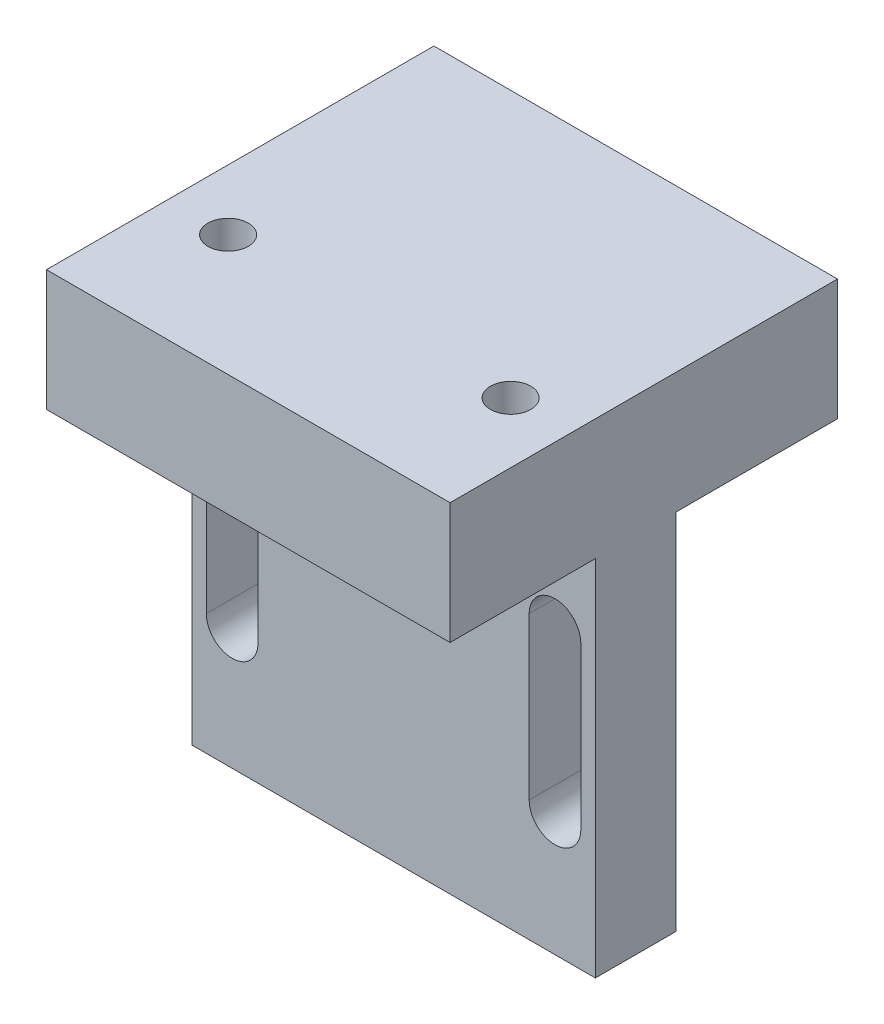
ISO-10303-21;
HEADER;
FILE_DESCRIPTION(('STEP AP214'),'2;1');
FILE_NAME('part.step','',(''),(''),'','','');
FILE_SCHEMA(('AUTOMOTIVE_DESIGN { 1 0 10303 214 1 1 1 1 }'));
ENDSEC;
DATA;
#1=APPLICATION_CONTEXT('core data for automotive mechanical design processes');
#2=APPLICATION_PROTOCOL_DEFINITION('international standard','automotive_design',2000,#1);
#3=PRODUCT_CONTEXT('',#1,'mechanical');
#4=PRODUCT('Part','Part','',(#3));
#5=PRODUCT_RELATED_PRODUCT_CATEGORY('part','',(#4));
#6=PRODUCT_DEFINITION_FORMATION('','',#4);
#7=PRODUCT_DEFINITION_CONTEXT('part definition',#1,'design');
#8=PRODUCT_DEFINITION('design','',#6,#7);
#9=PRODUCT_DEFINITION_SHAPE('','',#8);
#10=(LENGTH_UNIT() NAMED_UNIT(*) SI_UNIT(.MILLI.,.METRE.));
#11=(NAMED_UNIT(*) PLANE_ANGLE_UNIT() SI_UNIT($,.RADIAN.));
#12=(NAMED_UNIT(*) SI_UNIT($,.STERADIAN.) SOLID_ANGLE_UNIT());
#13=UNCERTAINTY_MEASURE_WITH_UNIT(LENGTH_MEASURE(1.E-05),#10,'distance_accuracy_value','');
#14=(GEOMETRIC_REPRESENTATION_CONTEXT(3) GLOBAL_UNCERTAINTY_ASSIGNED_CONTEXT((#13)) GLOBAL_UNIT_ASSIGNED_CONTEXT((#10,
#11,#12)) REPRESENTATION_CONTEXT('',''));
#15=CARTESIAN_POINT('',(0.,0.,0.));
#16=DIRECTION('',(0.,0.,1.));
#17=DIRECTION('',(1.,0.,0.));
#18=AXIS2_PLACEMENT_3D('',#15,#16,#17);
#19=CARTESIAN_POINT('',(-25.,-30.,30.));
#20=DIRECTION('',(1.,0.,0.));
#21=DIRECTION('',(0.,0.,-1.));
#22=AXIS2_PLACEMENT_3D('',#19,#20,#21);
#23=PLANE('',#22);
#24=DIRECTION('',(0.,0.,-1.));
#25=VECTOR('',#24,1.);
#26=CARTESIAN_POINT('',(-25.,15.,97.2681202353686));
#27=LINE('',#26,#25);
#28=CARTESIAN_POINT('',(-25.,15.,20.));
#29=VERTEX_POINT('',#28);
#30=CARTESIAN_POINT('',(-25.,15.,0.));
#31=VERTEX_POINT('',#30);
#32=EDGE_CURVE('E268',#29,#31,#27,.T.);
#33=ORIENTED_EDGE('',*,*,#32,.F.);
#34=DIRECTION('',(0.,1.,0.));
#35=VECTOR('',#34,1.);
#36=CARTESIAN_POINT('',(-25.,-30.,20.));
#37=LINE('',#36,#35);
#38=CARTESIAN_POINT('',(-25.,-30.,20.));
#39=VERTEX_POINT('',#38);
#40=EDGE_CURVE('E260',#39,#29,#37,.T.);
#41=ORIENTED_EDGE('',*,*,#40,.F.);
#42=DIRECTION('',(0.,0.,-1.));
#43=VECTOR('',#42,1.);
#44=CARTESIAN_POINT('',(-25.,-30.,30.));
#45=LINE('',#44,#43);
#46=CARTESIAN_POINT('',(-25.,-30.,30.));
#47=VERTEX_POINT('',#46);
#48=EDGE_CURVE('E12',#47,#39,#45,.T.);
#49=ORIENTED_EDGE('',*,*,#48,.F.);
#50=DIRECTION('',(0.,-1.,0.));
#51=VECTOR('',#50,1.);
#52=CARTESIAN_POINT('',(-25.,-30.,30.));
#53=LINE('',#52,#51);
#54=CARTESIAN_POINT('',(-25.,15.,30.));
#55=VERTEX_POINT('',#54);
#56=EDGE_CURVE('E277',#55,#47,#53,.T.);
#57=ORIENTED_EDGE('',*,*,#56,.F.);
#58=DIRECTION('',(0.,0.,-1.));
#59=VECTOR('',#58,1.);
#60=CARTESIAN_POINT('',(-25.,15.,48.));
#61=LINE('',#60,#59);
#62=CARTESIAN_POINT('',(-25.,15.,48.));
#63=VERTEX_POINT('',#62);
#64=EDGE_CURVE('E168',#63,#55,#61,.T.);
#65=ORIENTED_EDGE('',*,*,#64,.F.);
#66=DIRECTION('',(0.,-1.,0.));
#67=VECTOR('',#66,1.);
#68=CARTESIAN_POINT('',(-25.,30.,48.));
#69=LINE('',#68,#67);
#70=CARTESIAN_POINT('',(-25.,30.,48.));
#71=VERTEX_POINT('',#70);
#72=EDGE_CURVE('E165',#71,#63,#69,.T.);
#73=ORIENTED_EDGE('',*,*,#72,.F.);
#74=DIRECTION('',(0.,0.,-1.));
#75=VECTOR('',#74,1.);
#76=CARTESIAN_POINT('',(-25.,30.,30.));
#77=LINE('',#76,#75);
#78=CARTESIAN_POINT('',(-25.,30.,0.));
#79=VERTEX_POINT('',#78);
#80=EDGE_CURVE('E150',#71,#79,#77,.T.);
#81=ORIENTED_EDGE('',*,*,#80,.T.);
#82=DIRECTION('',(0.,-1.,0.));
#83=VECTOR('',#82,1.);
#84=CARTESIAN_POINT('',(-25.,-30.,0.));
#85=LINE('',#84,#83);
#86=EDGE_CURVE('E263',#79,#31,#85,.T.);
#87=ORIENTED_EDGE('',*,*,#86,.T.);
#88=EDGE_LOOP('',(#33,#41,#49,#57,#65,#73,#81,#87));
#89=FACE_BOUND('',#88,.T.);
#90=ADVANCED_FACE('F36',(#89),#23,.F.);
#91=CARTESIAN_POINT('',(25.,-30.,30.));
#92=DIRECTION('',(0.,1.,0.));
#93=DIRECTION('',(-1.,0.,0.));
#94=AXIS2_PLACEMENT_3D('',#91,#92,#93);
#95=PLANE('',#94);
#96=ORIENTED_EDGE('',*,*,#48,.T.);
#97=DIRECTION('',(-1.,0.,0.));
#98=VECTOR('',#97,1.);
#99=CARTESIAN_POINT('',(25.,-30.,20.));
#100=LINE('',#99,#98);
#101=CARTESIAN_POINT('',(25.,-30.,20.));
#102=VERTEX_POINT('',#101);
#103=EDGE_CURVE('E258',#102,#39,#100,.T.);
#104=ORIENTED_EDGE('',*,*,#103,.F.);
#105=DIRECTION('',(0.,0.,-1.));
#106=VECTOR('',#105,1.);
#107=CARTESIAN_POINT('',(25.,-30.,30.));
#108=LINE('',#107,#106);
#109=CARTESIAN_POINT('',(25.,-30.,30.));
#110=VERTEX_POINT('',#109);
#111=EDGE_CURVE('E44',#110,#102,#108,.T.);
#112=ORIENTED_EDGE('',*,*,#111,.F.);
#113=DIRECTION('',(1.,0.,0.));
#114=VECTOR('',#113,1.);
#115=CARTESIAN_POINT('',(25.,-30.,30.));
#116=LINE('',#115,#114);
#117=EDGE_CURVE('E276',#47,#110,#116,.T.);
#118=ORIENTED_EDGE('',*,*,#117,.F.);
#119=EDGE_LOOP('',(#96,#104,#112,#118));
#120=FACE_BOUND('',#119,.T.);
#121=ADVANCED_FACE('F302',(#120),#95,.F.);
#122=CARTESIAN_POINT('',(25.,-30.,30.));
#123=DIRECTION('',(-1.,0.,0.));
#124=DIRECTION('',(0.,0.,1.));
#125=AXIS2_PLACEMENT_3D('',#122,#123,#124);
#126=PLANE('',#125);
#127=ORIENTED_EDGE('',*,*,#111,.T.);
#128=DIRECTION('',(0.,-1.,0.));
#129=VECTOR('',#128,1.);
#130=CARTESIAN_POINT('',(25.,-30.,20.));
#131=LINE('',#130,#129);
#132=CARTESIAN_POINT('',(25.,15.,20.));
#133=VERTEX_POINT('',#132);
#134=EDGE_CURVE('E261',#133,#102,#131,.T.);
#135=ORIENTED_EDGE('',*,*,#134,.F.);
#136=DIRECTION('',(0.,0.,-1.));
#137=VECTOR('',#136,1.);
#138=CARTESIAN_POINT('',(25.,15.,97.2681202353686));
#139=LINE('',#138,#137);
#140=CARTESIAN_POINT('',(25.,15.,0.));
#141=VERTEX_POINT('',#140);
#142=EDGE_CURVE('E264',#133,#141,#139,.T.);
#143=ORIENTED_EDGE('',*,*,#142,.T.);
#144=DIRECTION('',(0.,1.,0.));
#145=VECTOR('',#144,1.);
#146=CARTESIAN_POINT('',(25.,-30.,0.));
#147=LINE('',#146,#145);
#148=CARTESIAN_POINT('',(25.,30.,0.));
#149=VERTEX_POINT('',#148);
#150=EDGE_CURVE('E283',#141,#149,#147,.T.);
#151=ORIENTED_EDGE('',*,*,#150,.T.);
#152=DIRECTION('',(0.,0.,-1.));
#153=VECTOR('',#152,1.);
#154=CARTESIAN_POINT('',(25.,30.,30.));
#155=LINE('',#154,#153);
#156=CARTESIAN_POINT('',(25.,30.,48.));
#157=VERTEX_POINT('',#156);
#158=EDGE_CURVE('E161',#157,#149,#155,.T.);
#159=ORIENTED_EDGE('',*,*,#158,.F.);
#160=DIRECTION('',(0.,1.,0.));
#161=VECTOR('',#160,1.);
#162=CARTESIAN_POINT('',(25.,15.,48.));
#163=LINE('',#162,#161);
#164=CARTESIAN_POINT('',(25.,15.,48.));
#165=VERTEX_POINT('',#164);
#166=EDGE_CURVE('E176',#165,#157,#163,.T.);
#167=ORIENTED_EDGE('',*,*,#166,.F.);
#168=DIRECTION('',(0.,0.,-1.));
#169=VECTOR('',#168,1.);
#170=CARTESIAN_POINT('',(25.,15.,48.));
#171=LINE('',#170,#169);
#172=CARTESIAN_POINT('',(25.,15.,30.));
#173=VERTEX_POINT('',#172);
#174=EDGE_CURVE('E185',#165,#173,#171,.T.);
#175=ORIENTED_EDGE('',*,*,#174,.T.);
#176=DIRECTION('',(0.,1.,0.));
#177=VECTOR('',#176,1.);
#178=CARTESIAN_POINT('',(25.,-30.,30.));
#179=LINE('',#178,#177);
#180=EDGE_CURVE('E162',#110,#173,#179,.T.);
#181=ORIENTED_EDGE('',*,*,#180,.F.);
#182=EDGE_LOOP('',(#127,#135,#143,#151,#159,#167,#175,#181));
#183=FACE_BOUND('',#182,.T.);
#184=ADVANCED_FACE('F295',(#183),#126,.F.);
#185=CARTESIAN_POINT('',(25.,30.,30.));
#186=DIRECTION('',(0.,-1.,0.));
#187=DIRECTION('',(1.,0.,0.));
#188=AXIS2_PLACEMENT_3D('',#185,#186,#187);
#189=PLANE('',#188);
#190=CARTESIAN_POINT('',(17.5,30.,33.));
#191=DIRECTION('',(0.,1.,0.));
#192=DIRECTION('',(0.,0.,1.));
#193=AXIS2_PLACEMENT_3D('',#190,#191,#192);
#194=CIRCLE('',#193,2.49999999999999);
#195=CARTESIAN_POINT('',(17.5,30.,35.5));
#196=VERTEX_POINT('',#195);
#197=EDGE_CURVE('E465',#196,#196,#194,.T.);
#198=ORIENTED_EDGE('',*,*,#197,.F.);
#199=EDGE_LOOP('',(#198));
#200=FACE_BOUND('',#199,.T.);
#201=CARTESIAN_POINT('',(-17.5,30.,33.));
#202=DIRECTION('',(0.,1.,0.));
#203=DIRECTION('',(0.,0.,1.));
#204=AXIS2_PLACEMENT_3D('',#201,#202,#203);
#205=CIRCLE('',#204,2.49999999999999);
#206=CARTESIAN_POINT('',(-17.5,30.,35.5));
#207=VERTEX_POINT('',#206);
#208=EDGE_CURVE('E467',#207,#207,#205,.T.);
#209=ORIENTED_EDGE('',*,*,#208,.F.);
#210=EDGE_LOOP('',(#209));
#211=FACE_BOUND('',#210,.T.);
#212=DIRECTION('',(-1.,0.,0.));
#213=VECTOR('',#212,1.);
#214=CARTESIAN_POINT('',(25.,30.,0.));
#215=LINE('',#214,#213);
#216=EDGE_CURVE('E157',#149,#79,#215,.T.);
#217=ORIENTED_EDGE('',*,*,#216,.T.);
#218=ORIENTED_EDGE('',*,*,#80,.F.);
#219=DIRECTION('',(-1.,0.,0.));
#220=VECTOR('',#219,1.);
#221=CARTESIAN_POINT('',(25.,30.,48.));
#222=LINE('',#221,#220);
#223=EDGE_CURVE('E155',#157,#71,#222,.T.);
#224=ORIENTED_EDGE('',*,*,#223,.F.);
#225=ORIENTED_EDGE('',*,*,#158,.T.);
#226=EDGE_LOOP('',(#217,#218,#224,#225));
#227=FACE_BOUND('',#226,.T.);
#228=ADVANCED_FACE('F152',(#200,#211,#227),#189,.F.);
#229=CARTESIAN_POINT('',(0.,0.,30.));
#230=DIRECTION('',(0.,0.,1.));
#231=DIRECTION('',(1.,0.,0.));
#232=AXIS2_PLACEMENT_3D('',#229,#230,#231);
#233=PLANE('',#232);
#234=DIRECTION('',(1.,0.,0.));
#235=VECTOR('',#234,1.);
#236=CARTESIAN_POINT('',(-25.,15.,30.));
#237=LINE('',#236,#235);
#238=EDGE_CURVE('E52',#55,#173,#237,.T.);
#239=ORIENTED_EDGE('',*,*,#238,.F.);
#240=ORIENTED_EDGE('',*,*,#56,.T.);
#241=ORIENTED_EDGE('',*,*,#117,.T.);
#242=ORIENTED_EDGE('',*,*,#180,.T.);
#243=EDGE_LOOP('',(#239,#240,#241,#242));
#244=FACE_BOUND('',#243,.T.);
#245=CARTESIAN_POINT('',(-20.,-15.,30.));
#246=DIRECTION('',(0.,0.,-1.));
#247=DIRECTION('',(1.,0.,0.));
#248=AXIS2_PLACEMENT_3D('',#245,#246,#247);
#249=CIRCLE('',#248,3.20000000000001);
#250=CARTESIAN_POINT('',(-16.8,-15.,30.));
#251=VERTEX_POINT('',#250);
#252=CARTESIAN_POINT('',(-23.2,-15.,30.));
#253=VERTEX_POINT('',#252);
#254=EDGE_CURVE('E188',#251,#253,#249,.T.);
#255=ORIENTED_EDGE('',*,*,#254,.T.);
#256=DIRECTION('',(0.,1.,0.));
#257=VECTOR('',#256,1.);
#258=CARTESIAN_POINT('',(-23.2,-15.,30.));
#259=LINE('',#258,#257);
#260=CARTESIAN_POINT('',(-23.2,4.99999999999999,30.));
#261=VERTEX_POINT('',#260);
#262=EDGE_CURVE('E379',#253,#261,#259,.T.);
#263=ORIENTED_EDGE('',*,*,#262,.T.);
#264=CARTESIAN_POINT('',(-20.,4.99999999999999,30.));
#265=DIRECTION('',(0.,0.,-1.));
#266=DIRECTION('',(1.,0.,0.));
#267=AXIS2_PLACEMENT_3D('',#264,#265,#266);
#268=CIRCLE('',#267,3.20000000000001);
#269=CARTESIAN_POINT('',(-16.8,5.,30.));
#270=VERTEX_POINT('',#269);
#271=EDGE_CURVE('E60',#261,#270,#268,.T.);
#272=ORIENTED_EDGE('',*,*,#271,.T.);
#273=DIRECTION('',(0.,-1.,0.));
#274=VECTOR('',#273,1.);
#275=CARTESIAN_POINT('',(-16.8,-15.,30.));
#276=LINE('',#275,#274);
#277=EDGE_CURVE('E208',#270,#251,#276,.T.);
#278=ORIENTED_EDGE('',*,*,#277,.T.);
#279=EDGE_LOOP('',(#255,#263,#272,#278));
#280=FACE_BOUND('',#279,.T.);
#281=CARTESIAN_POINT('',(20.,-15.,30.));
#282=DIRECTION('',(0.,0.,-1.));
#283=DIRECTION('',(-1.,0.,0.));
#284=AXIS2_PLACEMENT_3D('',#281,#282,#283);
#285=CIRCLE('',#284,3.20000000000001);
#286=CARTESIAN_POINT('',(23.2,-15.,30.));
#287=VERTEX_POINT('',#286);
#288=CARTESIAN_POINT('',(16.8,-15.,30.));
#289=VERTEX_POINT('',#288);
#290=EDGE_CURVE('E225',#287,#289,#285,.T.);
#291=ORIENTED_EDGE('',*,*,#290,.T.);
#292=DIRECTION('',(0.,1.,0.));
#293=VECTOR('',#292,1.);
#294=CARTESIAN_POINT('',(16.8,-15.,30.));
#295=LINE('',#294,#293);
#296=CARTESIAN_POINT('',(16.8,5.00000000000001,30.));
#297=VERTEX_POINT('',#296);
#298=EDGE_CURVE('E228',#289,#297,#295,.T.);
#299=ORIENTED_EDGE('',*,*,#298,.T.);
#300=CARTESIAN_POINT('',(20.,5.,30.));
#301=DIRECTION('',(0.,0.,-1.));
#302=DIRECTION('',(-1.,0.,0.));
#303=AXIS2_PLACEMENT_3D('',#300,#301,#302);
#304=CIRCLE('',#303,3.20000000000001);
#305=CARTESIAN_POINT('',(23.2,5.00000000000001,30.));
#306=VERTEX_POINT('',#305);
#307=EDGE_CURVE('E232',#297,#306,#304,.T.);
#308=ORIENTED_EDGE('',*,*,#307,.T.);
#309=DIRECTION('',(0.,-1.,0.));
#310=VECTOR('',#309,1.);
#311=CARTESIAN_POINT('',(23.2,-15.,30.));
#312=LINE('',#311,#310);
#313=EDGE_CURVE('E235',#306,#287,#312,.T.);
#314=ORIENTED_EDGE('',*,*,#313,.T.);
#315=EDGE_LOOP('',(#291,#299,#308,#314));
#316=FACE_BOUND('',#315,.T.);
#317=ADVANCED_FACE('F305',(#244,#280,#316),#233,.T.);
#318=CARTESIAN_POINT('',(0.,0.,0.));
#319=DIRECTION('',(0.,0.,1.));
#320=DIRECTION('',(1.,0.,0.));
#321=AXIS2_PLACEMENT_3D('',#318,#319,#320);
#322=PLANE('',#321);
#323=ORIENTED_EDGE('',*,*,#150,.F.);
#324=DIRECTION('',(1.,0.,0.));
#325=VECTOR('',#324,1.);
#326=CARTESIAN_POINT('',(25.,15.,0.));
#327=LINE('',#326,#325);
#328=EDGE_CURVE('E250',#31,#141,#327,.T.);
#329=ORIENTED_EDGE('',*,*,#328,.F.);
#330=ORIENTED_EDGE('',*,*,#86,.F.);
#331=ORIENTED_EDGE('',*,*,#216,.F.);
#332=EDGE_LOOP('',(#323,#329,#330,#331));
#333=FACE_BOUND('',#332,.T.);
#334=ADVANCED_FACE('F290',(#333),#322,.F.);
#335=CARTESIAN_POINT('',(0.,0.,20.));
#336=DIRECTION('',(0.,0.,1.));
#337=DIRECTION('',(1.,0.,0.));
#338=AXIS2_PLACEMENT_3D('',#335,#336,#337);
#339=PLANE('',#338);
#340=DIRECTION('',(0.,1.,0.));
#341=VECTOR('',#340,1.);
#342=CARTESIAN_POINT('',(-23.2,-15.,20.));
#343=LINE('',#342,#341);
#344=CARTESIAN_POINT('',(-23.2,-15.,20.));
#345=VERTEX_POINT('',#344);
#346=CARTESIAN_POINT('',(-23.2,4.99999999999999,20.));
#347=VERTEX_POINT('',#346);
#348=EDGE_CURVE('E199',#345,#347,#343,.T.);
#349=ORIENTED_EDGE('',*,*,#348,.F.);
#350=CARTESIAN_POINT('',(-20.,-15.,20.));
#351=DIRECTION('',(0.,0.,-1.));
#352=DIRECTION('',(1.,0.,0.));
#353=AXIS2_PLACEMENT_3D('',#350,#351,#352);
#354=CIRCLE('',#353,3.20000000000001);
#355=CARTESIAN_POINT('',(-16.8,-15.,20.));
#356=VERTEX_POINT('',#355);
#357=EDGE_CURVE('E197',#356,#345,#354,.T.);
#358=ORIENTED_EDGE('',*,*,#357,.F.);
#359=DIRECTION('',(0.,-1.,0.));
#360=VECTOR('',#359,1.);
#361=CARTESIAN_POINT('',(-16.8,-15.,20.));
#362=LINE('',#361,#360);
#363=CARTESIAN_POINT('',(-16.8,5.,20.));
#364=VERTEX_POINT('',#363);
#365=EDGE_CURVE('E213',#364,#356,#362,.T.);
#366=ORIENTED_EDGE('',*,*,#365,.F.);
#367=CARTESIAN_POINT('',(-20.,4.99999999999999,20.));
#368=DIRECTION('',(0.,0.,-1.));
#369=DIRECTION('',(1.,0.,0.));
#370=AXIS2_PLACEMENT_3D('',#367,#368,#369);
#371=CIRCLE('',#370,3.20000000000001);
#372=EDGE_CURVE('E205',#347,#364,#371,.T.);
#373=ORIENTED_EDGE('',*,*,#372,.F.);
#374=EDGE_LOOP('',(#349,#358,#366,#373));
#375=FACE_BOUND('',#374,.T.);
#376=DIRECTION('',(0.,1.,0.));
#377=VECTOR('',#376,1.);
#378=CARTESIAN_POINT('',(16.8,-15.,20.));
#379=LINE('',#378,#377);
#380=CARTESIAN_POINT('',(16.8,-15.,20.));
#381=VERTEX_POINT('',#380);
#382=CARTESIAN_POINT('',(16.8,5.00000000000001,20.));
#383=VERTEX_POINT('',#382);
#384=EDGE_CURVE('E240',#381,#383,#379,.T.);
#385=ORIENTED_EDGE('',*,*,#384,.F.);
#386=CARTESIAN_POINT('',(20.,-15.,20.));
#387=DIRECTION('',(0.,0.,-1.));
#388=DIRECTION('',(-1.,0.,0.));
#389=AXIS2_PLACEMENT_3D('',#386,#387,#388);
#390=CIRCLE('',#389,3.20000000000001);
#391=CARTESIAN_POINT('',(23.2,-15.,20.));
#392=VERTEX_POINT('',#391);
#393=EDGE_CURVE('E218',#392,#381,#390,.T.);
#394=ORIENTED_EDGE('',*,*,#393,.F.);
#395=DIRECTION('',(0.,-1.,0.));
#396=VECTOR('',#395,1.);
#397=CARTESIAN_POINT('',(23.2,-15.,20.));
#398=LINE('',#397,#396);
#399=CARTESIAN_POINT('',(23.2,5.00000000000001,20.));
#400=VERTEX_POINT('',#399);
#401=EDGE_CURVE('E229',#400,#392,#398,.T.);
#402=ORIENTED_EDGE('',*,*,#401,.F.);
#403=CARTESIAN_POINT('',(20.,5.,20.));
#404=DIRECTION('',(0.,0.,-1.));
#405=DIRECTION('',(-1.,0.,0.));
#406=AXIS2_PLACEMENT_3D('',#403,#404,#405);
#407=CIRCLE('',#406,3.20000000000001);
#408=EDGE_CURVE('E243',#383,#400,#407,.T.);
#409=ORIENTED_EDGE('',*,*,#408,.F.);
#410=EDGE_LOOP('',(#385,#394,#402,#409));
#411=FACE_BOUND('',#410,.T.);
#412=ORIENTED_EDGE('',*,*,#134,.T.);
#413=ORIENTED_EDGE('',*,*,#103,.T.);
#414=ORIENTED_EDGE('',*,*,#40,.T.);
#415=DIRECTION('',(1.,0.,0.));
#416=VECTOR('',#415,1.);
#417=CARTESIAN_POINT('',(25.,15.,20.));
#418=LINE('',#417,#416);
#419=EDGE_CURVE('E265',#29,#133,#418,.T.);
#420=ORIENTED_EDGE('',*,*,#419,.T.);
#421=EDGE_LOOP('',(#412,#413,#414,#420));
#422=FACE_BOUND('',#421,.T.);
#423=ADVANCED_FACE('F300',(#375,#411,#422),#339,.F.);
#424=CARTESIAN_POINT('',(25.,15.,97.2681202353686));
#425=DIRECTION('',(0.,1.,0.));
#426=DIRECTION('',(0.,0.,1.));
#427=AXIS2_PLACEMENT_3D('',#424,#425,#426);
#428=PLANE('',#427);
#429=ORIENTED_EDGE('',*,*,#32,.T.);
#430=ORIENTED_EDGE('',*,*,#328,.T.);
#431=ORIENTED_EDGE('',*,*,#142,.F.);
#432=ORIENTED_EDGE('',*,*,#419,.F.);
#433=EDGE_LOOP('',(#429,#430,#431,#432));
#434=FACE_BOUND('',#433,.T.);
#435=ADVANCED_FACE('F292',(#434),#428,.F.);
#436=CARTESIAN_POINT('',(20.,-15.,30.));
#437=DIRECTION('',(0.,0.,-1.));
#438=DIRECTION('',(-1.,0.,0.));
#439=AXIS2_PLACEMENT_3D('',#436,#437,#438);
#440=CYLINDRICAL_SURFACE('',#439,3.20000000000001);
#441=ORIENTED_EDGE('',*,*,#393,.T.);
#442=DIRECTION('',(0.,0.,-1.));
#443=VECTOR('',#442,1.);
#444=CARTESIAN_POINT('',(16.8,-15.,30.));
#445=LINE('',#444,#443);
#446=EDGE_CURVE('E238',#289,#381,#445,.T.);
#447=ORIENTED_EDGE('',*,*,#446,.F.);
#448=ORIENTED_EDGE('',*,*,#290,.F.);
#449=DIRECTION('',(0.,0.,-1.));
#450=VECTOR('',#449,1.);
#451=CARTESIAN_POINT('',(23.2,-15.,30.));
#452=LINE('',#451,#450);
#453=EDGE_CURVE('E248',#287,#392,#452,.T.);
#454=ORIENTED_EDGE('',*,*,#453,.T.);
#455=EDGE_LOOP('',(#441,#447,#448,#454));
#456=FACE_BOUND('',#455,.T.);
#457=ADVANCED_FACE('F346',(#456),#440,.F.);
#458=CARTESIAN_POINT('',(23.2,-15.,30.));
#459=DIRECTION('',(1.,0.,0.));
#460=DIRECTION('',(0.,0.,-1.));
#461=AXIS2_PLACEMENT_3D('',#458,#459,#460);
#462=PLANE('',#461);
#463=ORIENTED_EDGE('',*,*,#401,.T.);
#464=ORIENTED_EDGE('',*,*,#453,.F.);
#465=ORIENTED_EDGE('',*,*,#313,.F.);
#466=DIRECTION('',(0.,0.,-1.));
#467=VECTOR('',#466,1.);
#468=CARTESIAN_POINT('',(23.2,5.00000000000001,30.));
#469=LINE('',#468,#467);
#470=EDGE_CURVE('E251',#306,#400,#469,.T.);
#471=ORIENTED_EDGE('',*,*,#470,.T.);
#472=EDGE_LOOP('',(#463,#464,#465,#471));
#473=FACE_BOUND('',#472,.T.);
#474=ADVANCED_FACE('F349',(#473),#462,.F.);
#475=CARTESIAN_POINT('',(20.,5.,30.));
#476=DIRECTION('',(0.,0.,-1.));
#477=DIRECTION('',(-1.,0.,0.));
#478=AXIS2_PLACEMENT_3D('',#475,#476,#477);
#479=CYLINDRICAL_SURFACE('',#478,3.20000000000001);
#480=ORIENTED_EDGE('',*,*,#408,.T.);
#481=ORIENTED_EDGE('',*,*,#470,.F.);
#482=ORIENTED_EDGE('',*,*,#307,.F.);
#483=DIRECTION('',(0.,0.,-1.));
#484=VECTOR('',#483,1.);
#485=CARTESIAN_POINT('',(16.8,5.00000000000001,30.));
#486=LINE('',#485,#484);
#487=EDGE_CURVE('E253',#297,#383,#486,.T.);
#488=ORIENTED_EDGE('',*,*,#487,.T.);
#489=EDGE_LOOP('',(#480,#481,#482,#488));
#490=FACE_BOUND('',#489,.T.);
#491=ADVANCED_FACE('F355',(#490),#479,.F.);
#492=CARTESIAN_POINT('',(16.8,-15.,30.));
#493=DIRECTION('',(-1.,0.,0.));
#494=DIRECTION('',(0.,-1.,0.));
#495=AXIS2_PLACEMENT_3D('',#492,#493,#494);
#496=PLANE('',#495);
#497=ORIENTED_EDGE('',*,*,#384,.T.);
#498=ORIENTED_EDGE('',*,*,#487,.F.);
#499=ORIENTED_EDGE('',*,*,#298,.F.);
#500=ORIENTED_EDGE('',*,*,#446,.T.);
#501=EDGE_LOOP('',(#497,#498,#499,#500));
#502=FACE_BOUND('',#501,.T.);
#503=ADVANCED_FACE('F351',(#502),#496,.F.);
#504=CARTESIAN_POINT('',(-20.,-15.,30.));
#505=DIRECTION('',(0.,0.,-1.));
#506=DIRECTION('',(-1.,0.,0.));
#507=AXIS2_PLACEMENT_3D('',#504,#505,#506);
#508=CYLINDRICAL_SURFACE('',#507,3.20000000000001);
#509=ORIENTED_EDGE('',*,*,#357,.T.);
#510=DIRECTION('',(0.,0.,-1.));
#511=VECTOR('',#510,1.);
#512=CARTESIAN_POINT('',(-23.2,-15.,30.));
#513=LINE('',#512,#511);
#514=EDGE_CURVE('E223',#253,#345,#513,.T.);
#515=ORIENTED_EDGE('',*,*,#514,.F.);
#516=ORIENTED_EDGE('',*,*,#254,.F.);
#517=DIRECTION('',(0.,0.,-1.));
#518=VECTOR('',#517,1.);
#519=CARTESIAN_POINT('',(-16.8,-15.,30.));
#520=LINE('',#519,#518);
#521=EDGE_CURVE('E216',#251,#356,#520,.T.);
#522=ORIENTED_EDGE('',*,*,#521,.T.);
#523=EDGE_LOOP('',(#509,#515,#516,#522));
#524=FACE_BOUND('',#523,.T.);
#525=ADVANCED_FACE('F354',(#524),#508,.F.);
#526=CARTESIAN_POINT('',(-16.8,-15.,30.));
#527=DIRECTION('',(1.,0.,0.));
#528=DIRECTION('',(0.,1.,0.));
#529=AXIS2_PLACEMENT_3D('',#526,#527,#528);
#530=PLANE('',#529);
#531=ORIENTED_EDGE('',*,*,#365,.T.);
#532=ORIENTED_EDGE('',*,*,#521,.F.);
#533=ORIENTED_EDGE('',*,*,#277,.F.);
#534=DIRECTION('',(0.,0.,-1.));
#535=VECTOR('',#534,1.);
#536=CARTESIAN_POINT('',(-16.8,5.,30.));
#537=LINE('',#536,#535);
#538=EDGE_CURVE('E219',#270,#364,#537,.T.);
#539=ORIENTED_EDGE('',*,*,#538,.T.);
#540=EDGE_LOOP('',(#531,#532,#533,#539));
#541=FACE_BOUND('',#540,.T.);
#542=ADVANCED_FACE('F364',(#541),#530,.F.);
#543=CARTESIAN_POINT('',(-20.,4.99999999999999,30.));
#544=DIRECTION('',(0.,0.,-1.));
#545=DIRECTION('',(-1.,0.,0.));
#546=AXIS2_PLACEMENT_3D('',#543,#544,#545);
#547=CYLINDRICAL_SURFACE('',#546,3.20000000000001);
#548=ORIENTED_EDGE('',*,*,#372,.T.);
#549=ORIENTED_EDGE('',*,*,#538,.F.);
#550=ORIENTED_EDGE('',*,*,#271,.F.);
#551=DIRECTION('',(0.,0.,-1.));
#552=VECTOR('',#551,1.);
#553=CARTESIAN_POINT('',(-23.2,4.99999999999999,30.));
#554=LINE('',#553,#552);
#555=EDGE_CURVE('E221',#261,#347,#554,.T.);
#556=ORIENTED_EDGE('',*,*,#555,.T.);
#557=EDGE_LOOP('',(#548,#549,#550,#556));
#558=FACE_BOUND('',#557,.T.);
#559=ADVANCED_FACE('F319',(#558),#547,.F.);
#560=CARTESIAN_POINT('',(-23.2,-15.,30.));
#561=DIRECTION('',(-1.,0.,0.));
#562=DIRECTION('',(0.,-1.,0.));
#563=AXIS2_PLACEMENT_3D('',#560,#561,#562);
#564=PLANE('',#563);
#565=ORIENTED_EDGE('',*,*,#348,.T.);
#566=ORIENTED_EDGE('',*,*,#555,.F.);
#567=ORIENTED_EDGE('',*,*,#262,.F.);
#568=ORIENTED_EDGE('',*,*,#514,.T.);
#569=EDGE_LOOP('',(#565,#566,#567,#568));
#570=FACE_BOUND('',#569,.T.);
#571=ADVANCED_FACE('F310',(#570),#564,.F.);
#572=CARTESIAN_POINT('',(-25.,15.,48.));
#573=DIRECTION('',(0.,1.,0.));
#574=DIRECTION('',(0.,0.,1.));
#575=AXIS2_PLACEMENT_3D('',#572,#573,#574);
#576=PLANE('',#575);
#577=CARTESIAN_POINT('',(17.5,15.,33.));
#578=DIRECTION('',(0.,1.,0.));
#579=DIRECTION('',(0.,0.,1.));
#580=AXIS2_PLACEMENT_3D('',#577,#578,#579);
#581=CIRCLE('',#580,2.49999999999999);
#582=CARTESIAN_POINT('',(17.5,15.,35.5));
#583=VERTEX_POINT('',#582);
#584=EDGE_CURVE('E462',#583,#583,#581,.T.);
#585=ORIENTED_EDGE('',*,*,#584,.T.);
#586=EDGE_LOOP('',(#585));
#587=FACE_BOUND('',#586,.T.);
#588=CARTESIAN_POINT('',(-17.5,15.,33.));
#589=DIRECTION('',(0.,1.,0.));
#590=DIRECTION('',(0.,0.,1.));
#591=AXIS2_PLACEMENT_3D('',#588,#589,#590);
#592=CIRCLE('',#591,2.49999999999999);
#593=CARTESIAN_POINT('',(-17.5,15.,35.5));
#594=VERTEX_POINT('',#593);
#595=EDGE_CURVE('E178',#594,#594,#592,.T.);
#596=ORIENTED_EDGE('',*,*,#595,.T.);
#597=EDGE_LOOP('',(#596));
#598=FACE_BOUND('',#597,.T.);
#599=ORIENTED_EDGE('',*,*,#238,.T.);
#600=ORIENTED_EDGE('',*,*,#174,.F.);
#601=DIRECTION('',(1.,0.,0.));
#602=VECTOR('',#601,1.);
#603=CARTESIAN_POINT('',(-25.,15.,48.));
#604=LINE('',#603,#602);
#605=EDGE_CURVE('E171',#63,#165,#604,.T.);
#606=ORIENTED_EDGE('',*,*,#605,.F.);
#607=ORIENTED_EDGE('',*,*,#64,.T.);
#608=EDGE_LOOP('',(#599,#600,#606,#607));
#609=FACE_BOUND('',#608,.T.);
#610=ADVANCED_FACE('F308',(#587,#598,#609),#576,.F.);
#611=CARTESIAN_POINT('',(0.,0.,48.));
#612=DIRECTION('',(0.,0.,1.));
#613=DIRECTION('',(1.,0.,0.));
#614=AXIS2_PLACEMENT_3D('',#611,#612,#613);
#615=PLANE('',#614);
#616=ORIENTED_EDGE('',*,*,#223,.T.);
#617=ORIENTED_EDGE('',*,*,#72,.T.);
#618=ORIENTED_EDGE('',*,*,#605,.T.);
#619=ORIENTED_EDGE('',*,*,#166,.T.);
#620=EDGE_LOOP('',(#616,#617,#618,#619));
#621=FACE_BOUND('',#620,.T.);
#622=ADVANCED_FACE('F174',(#621),#615,.T.);
#623=CARTESIAN_POINT('',(-17.5,30.,33.));
#624=DIRECTION('',(0.,1.,0.));
#625=DIRECTION('',(0.,0.,1.));
#626=AXIS2_PLACEMENT_3D('',#623,#624,#625);
#627=CYLINDRICAL_SURFACE('',#626,2.49999999999999);
#628=ORIENTED_EDGE('',*,*,#595,.F.);
#629=EDGE_LOOP('',(#628));
#630=FACE_BOUND('',#629,.T.);
#631=ORIENTED_EDGE('',*,*,#208,.T.);
#632=EDGE_LOOP('',(#631));
#633=FACE_BOUND('',#632,.T.);
#634=ADVANCED_FACE('F317',(#630,#633),#627,.F.);
#635=CARTESIAN_POINT('',(17.5,30.,33.));
#636=DIRECTION('',(0.,1.,0.));
#637=DIRECTION('',(0.,0.,1.));
#638=AXIS2_PLACEMENT_3D('',#635,#636,#637);
#639=CYLINDRICAL_SURFACE('',#638,2.49999999999999);
#640=ORIENTED_EDGE('',*,*,#584,.F.);
#641=EDGE_LOOP('',(#640));
#642=FACE_BOUND('',#641,.T.);
#643=ORIENTED_EDGE('',*,*,#197,.T.);
#644=EDGE_LOOP('',(#643));
#645=FACE_BOUND('',#644,.T.);
#646=ADVANCED_FACE('F446',(#642,#645),#639,.F.);
#647=CLOSED_SHELL('',(#90,#121,#184,#228,#317,#334,#423,#435,#457,#474,#491,#503,#525,#542,#559,
#571,#610,#622,#634,#646));
#648=MANIFOLD_SOLID_BREP('B2',#647);
#649=ADVANCED_BREP_SHAPE_REPRESENTATION('',(#18,#648),#14);
#650=SHAPE_DEFINITION_REPRESENTATION(#9,#649);
ENDSEC;
END-ISO-10303-21;
